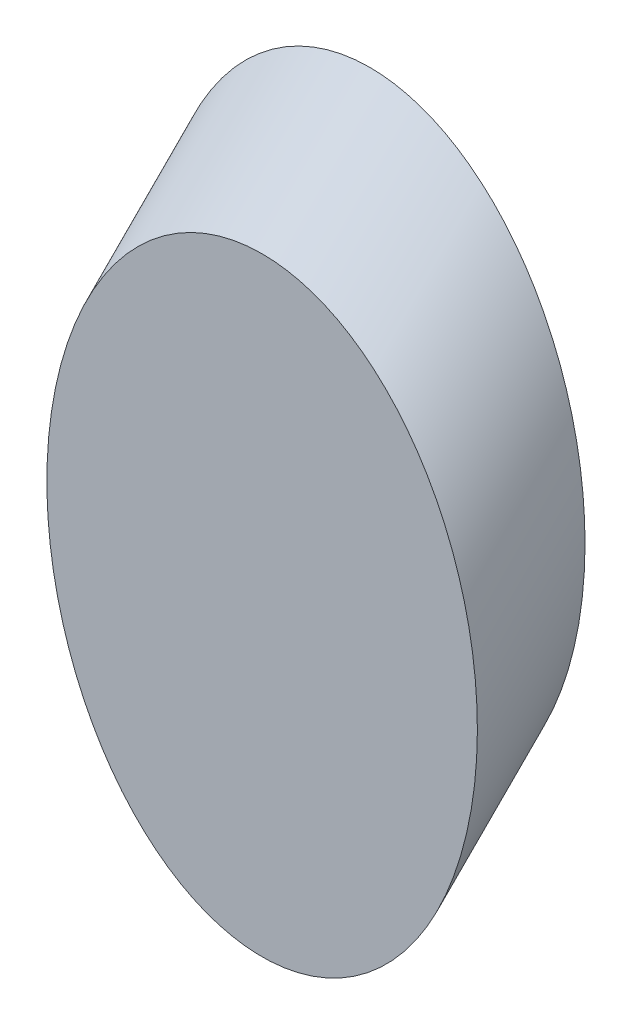
ISO-10303-21;
HEADER;
FILE_DESCRIPTION(('STEP AP214'),'2;1');
FILE_NAME('part.step','',(''),(''),'','','');
FILE_SCHEMA(('AUTOMOTIVE_DESIGN { 1 0 10303 214 1 1 1 1 }'));
ENDSEC;
DATA;
#1=APPLICATION_CONTEXT('core data for automotive mechanical design processes');
#2=APPLICATION_PROTOCOL_DEFINITION('international standard','automotive_design',2000,#1);
#3=PRODUCT_CONTEXT('',#1,'mechanical');
#4=PRODUCT('Part','Part','',(#3));
#5=PRODUCT_RELATED_PRODUCT_CATEGORY('part','',(#4));
#6=PRODUCT_DEFINITION_FORMATION('','',#4);
#7=PRODUCT_DEFINITION_CONTEXT('part definition',#1,'design');
#8=PRODUCT_DEFINITION('design','',#6,#7);
#9=PRODUCT_DEFINITION_SHAPE('','',#8);
#10=(LENGTH_UNIT() NAMED_UNIT(*) SI_UNIT(.MILLI.,.METRE.));
#11=(NAMED_UNIT(*) PLANE_ANGLE_UNIT() SI_UNIT($,.RADIAN.));
#12=(NAMED_UNIT(*) SI_UNIT($,.STERADIAN.) SOLID_ANGLE_UNIT());
#13=UNCERTAINTY_MEASURE_WITH_UNIT(LENGTH_MEASURE(1.E-05),#10,'distance_accuracy_value','');
#14=(GEOMETRIC_REPRESENTATION_CONTEXT(3) GLOBAL_UNCERTAINTY_ASSIGNED_CONTEXT((#13)) GLOBAL_UNIT_ASSIGNED_CONTEXT((#10,
#11,#12)) REPRESENTATION_CONTEXT('',''));
#15=CARTESIAN_POINT('',(0.,0.,0.));
#16=DIRECTION('',(0.,0.,1.));
#17=DIRECTION('',(1.,0.,0.));
#18=AXIS2_PLACEMENT_3D('',#15,#16,#17);
#19=CARTESIAN_POINT('',(54.3923829817161,48.2905194217003,-12.5016478913781));
#20=DIRECTION('',(0.,0.,1.));
#21=DIRECTION('',(0.,1.,0.));
#22=AXIS2_PLACEMENT_3D('',#19,#20,#21);
#23=ELLIPSE('',#22,35.36,25.);
#24=DIRECTION('',(0.,-0.707106781186549,0.707106781186546));
#25=VECTOR('',#24,1.);
#26=SURFACE_OF_LINEAR_EXTRUSION('',#23,#25);
#27=CARTESIAN_POINT('',(54.3923829817161,83.6505194217003,-12.5016478913781));
#28=VERTEX_POINT('',#27);
#29=EDGE_CURVE('E12',#28,#28,#23,.T.);
#30=ORIENTED_EDGE('',*,*,#29,.T.);
#31=EDGE_LOOP('',(#30));
#32=FACE_BOUND('',#31,.T.);
#33=CARTESIAN_POINT('',(54.3923829817161,35.7888715303221,0.));
#34=DIRECTION('',(0.,0.,1.));
#35=DIRECTION('',(0.,1.,0.));
#36=AXIS2_PLACEMENT_3D('',#33,#34,#35);
#37=ELLIPSE('',#36,35.36,25.);
#38=CARTESIAN_POINT('',(54.3923829817161,71.1488715303221,0.));
#39=VERTEX_POINT('',#38);
#40=EDGE_CURVE('E49',#39,#39,#37,.T.);
#41=ORIENTED_EDGE('',*,*,#40,.F.);
#42=EDGE_LOOP('',(#41));
#43=FACE_BOUND('',#42,.T.);
#44=ADVANCED_FACE('F45',(#32,#43),#26,.T.);
#45=CARTESIAN_POINT('',(54.3923829817161,48.2905194217003,-12.5016478913781));
#46=DIRECTION('',(0.,0.,1.));
#47=DIRECTION('',(1.,0.,0.));
#48=AXIS2_PLACEMENT_3D('',#45,#46,#47);
#49=PLANE('',#48);
#50=ORIENTED_EDGE('',*,*,#29,.F.);
#51=EDGE_LOOP('',(#50));
#52=FACE_BOUND('',#51,.T.);
#53=ADVANCED_FACE('F61',(#52),#49,.F.);
#54=CARTESIAN_POINT('',(54.3923829817161,35.7888715303221,0.));
#55=DIRECTION('',(0.,0.,1.));
#56=DIRECTION('',(1.,0.,0.));
#57=AXIS2_PLACEMENT_3D('',#54,#55,#56);
#58=PLANE('',#57);
#59=ORIENTED_EDGE('',*,*,#40,.T.);
#60=EDGE_LOOP('',(#59));
#61=FACE_BOUND('',#60,.T.);
#62=ADVANCED_FACE('F58',(#61),#58,.T.);
#63=CLOSED_SHELL('',(#44,#53,#62));
#64=MANIFOLD_SOLID_BREP('B2',#63);
#65=ADVANCED_BREP_SHAPE_REPRESENTATION('',(#18,#64),#14);
#66=SHAPE_DEFINITION_REPRESENTATION(#9,#65);
ENDSEC;
END-ISO-10303-21;
